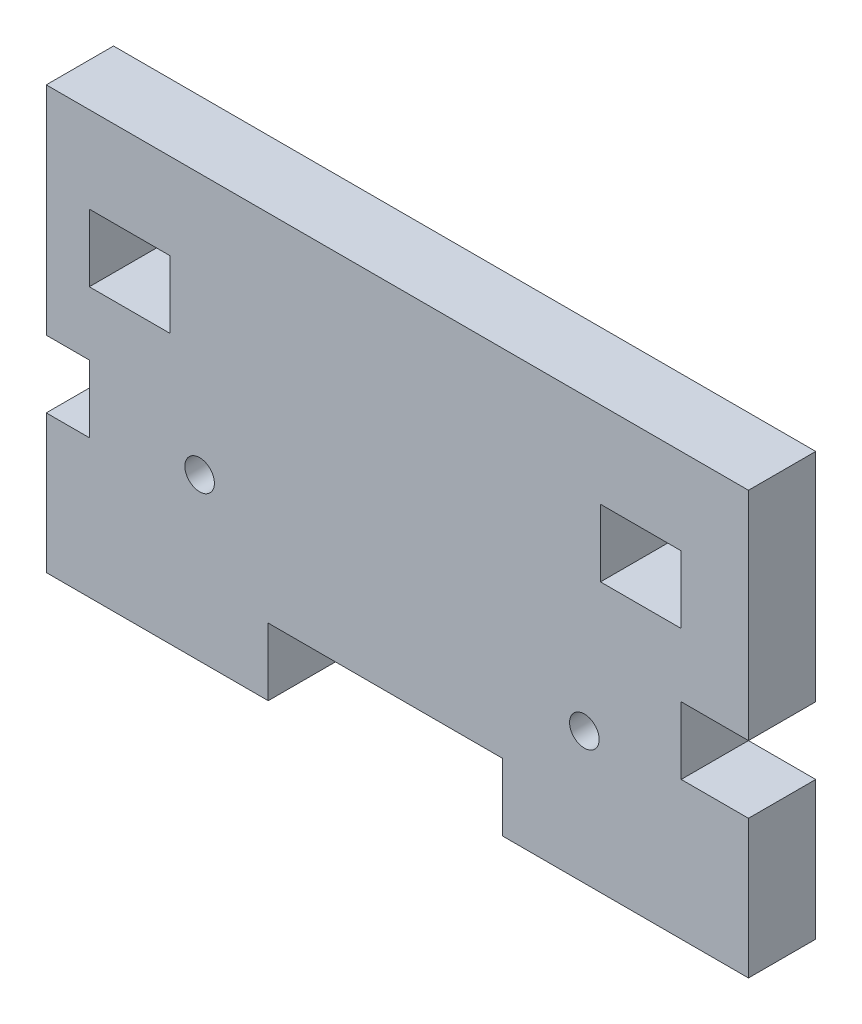
ISO-10303-21;
HEADER;
FILE_DESCRIPTION(('STEP AP214'),'2;1');
FILE_NAME('part.step','',(''),(''),'','','');
FILE_SCHEMA(('AUTOMOTIVE_DESIGN { 1 0 10303 214 1 1 1 1 }'));
ENDSEC;
DATA;
#1=APPLICATION_CONTEXT('core data for automotive mechanical design processes');
#2=APPLICATION_PROTOCOL_DEFINITION('international standard','automotive_design',2000,#1);
#3=PRODUCT_CONTEXT('',#1,'mechanical');
#4=PRODUCT('Part','Part','',(#3));
#5=PRODUCT_RELATED_PRODUCT_CATEGORY('part','',(#4));
#6=PRODUCT_DEFINITION_FORMATION('','',#4);
#7=PRODUCT_DEFINITION_CONTEXT('part definition',#1,'design');
#8=PRODUCT_DEFINITION('design','',#6,#7);
#9=PRODUCT_DEFINITION_SHAPE('','',#8);
#10=(LENGTH_UNIT() NAMED_UNIT(*) SI_UNIT(.MILLI.,.METRE.));
#11=(NAMED_UNIT(*) PLANE_ANGLE_UNIT() SI_UNIT($,.RADIAN.));
#12=(NAMED_UNIT(*) SI_UNIT($,.STERADIAN.) SOLID_ANGLE_UNIT());
#13=UNCERTAINTY_MEASURE_WITH_UNIT(LENGTH_MEASURE(1.E-05),#10,'distance_accuracy_value','');
#14=(GEOMETRIC_REPRESENTATION_CONTEXT(3) GLOBAL_UNCERTAINTY_ASSIGNED_CONTEXT((#13)) GLOBAL_UNIT_ASSIGNED_CONTEXT((#10,
#11,#12)) REPRESENTATION_CONTEXT('',''));
#15=CARTESIAN_POINT('',(0.,0.,0.));
#16=DIRECTION('',(0.,0.,1.));
#17=DIRECTION('',(1.,0.,0.));
#18=AXIS2_PLACEMENT_3D('',#15,#16,#17);
#19=CARTESIAN_POINT('',(33.147,-19.939,3.175));
#20=DIRECTION('',(-1.,0.,0.));
#21=DIRECTION('',(0.,0.,1.));
#22=AXIS2_PLACEMENT_3D('',#19,#20,#21);
#23=PLANE('',#22);
#24=DIRECTION('',(0.,1.,0.));
#25=VECTOR('',#24,1.);
#26=CARTESIAN_POINT('',(33.147,-19.939,3.175));
#27=LINE('',#26,#25);
#28=CARTESIAN_POINT('',(33.147,-0.52991232342499,3.175));
#29=VERTEX_POINT('',#28);
#30=CARTESIAN_POINT('',(33.147,19.939,3.175));
#31=VERTEX_POINT('',#30);
#32=EDGE_CURVE('E322',#29,#31,#27,.T.);
#33=ORIENTED_EDGE('',*,*,#32,.F.);
#34=DIRECTION('',(0.,0.,1.));
#35=VECTOR('',#34,1.);
#36=CARTESIAN_POINT('',(33.147,-0.52991232342499,3.175));
#37=LINE('',#36,#35);
#38=CARTESIAN_POINT('',(33.147,-0.529912323424989,-3.175));
#39=VERTEX_POINT('',#38);
#40=EDGE_CURVE('E233',#39,#29,#37,.T.);
#41=ORIENTED_EDGE('',*,*,#40,.F.);
#42=DIRECTION('',(0.,1.,0.));
#43=VECTOR('',#42,1.);
#44=CARTESIAN_POINT('',(33.147,-19.939,-3.175));
#45=LINE('',#44,#43);
#46=CARTESIAN_POINT('',(33.147,19.939,-3.175));
#47=VERTEX_POINT('',#46);
#48=EDGE_CURVE('E314',#39,#47,#45,.T.);
#49=ORIENTED_EDGE('',*,*,#48,.T.);
#50=DIRECTION('',(0.,0.,-1.));
#51=VECTOR('',#50,1.);
#52=CARTESIAN_POINT('',(33.147,19.939,3.175));
#53=LINE('',#52,#51);
#54=EDGE_CURVE('E355',#31,#47,#53,.T.);
#55=ORIENTED_EDGE('',*,*,#54,.F.);
#56=EDGE_LOOP('',(#33,#41,#49,#55));
#57=FACE_BOUND('',#56,.T.);
#58=ADVANCED_FACE('F45',(#57),#23,.F.);
#59=CARTESIAN_POINT('',(-33.147,-19.939,3.175));
#60=DIRECTION('',(1.,0.,0.));
#61=DIRECTION('',(0.,0.,-1.));
#62=AXIS2_PLACEMENT_3D('',#59,#60,#61);
#63=PLANE('',#62);
#64=DIRECTION('',(0.,-1.,0.));
#65=VECTOR('',#64,1.);
#66=CARTESIAN_POINT('',(-33.147,-19.939,-3.175));
#67=LINE('',#66,#65);
#68=CARTESIAN_POINT('',(-33.147,19.939,-3.175));
#69=VERTEX_POINT('',#68);
#70=CARTESIAN_POINT('',(-33.147,-0.529912323424995,-3.175));
#71=VERTEX_POINT('',#70);
#72=EDGE_CURVE('E341',#69,#71,#67,.T.);
#73=ORIENTED_EDGE('',*,*,#72,.T.);
#74=DIRECTION('',(0.,0.,1.));
#75=VECTOR('',#74,1.);
#76=CARTESIAN_POINT('',(-33.147,-0.529912323424996,3.175));
#77=LINE('',#76,#75);
#78=CARTESIAN_POINT('',(-33.147,-0.529912323424996,3.175));
#79=VERTEX_POINT('',#78);
#80=EDGE_CURVE('E398',#71,#79,#77,.T.);
#81=ORIENTED_EDGE('',*,*,#80,.T.);
#82=DIRECTION('',(0.,-1.,0.));
#83=VECTOR('',#82,1.);
#84=CARTESIAN_POINT('',(-33.147,-19.939,3.175));
#85=LINE('',#84,#83);
#86=CARTESIAN_POINT('',(-33.147,19.939,3.175));
#87=VERTEX_POINT('',#86);
#88=EDGE_CURVE('E333',#87,#79,#85,.T.);
#89=ORIENTED_EDGE('',*,*,#88,.F.);
#90=DIRECTION('',(0.,0.,-1.));
#91=VECTOR('',#90,1.);
#92=CARTESIAN_POINT('',(-33.147,19.939,3.175));
#93=LINE('',#92,#91);
#94=EDGE_CURVE('E352',#87,#69,#93,.T.);
#95=ORIENTED_EDGE('',*,*,#94,.T.);
#96=EDGE_LOOP('',(#73,#81,#89,#95));
#97=FACE_BOUND('',#96,.T.);
#98=ADVANCED_FACE('F474',(#97),#63,.F.);
#99=CARTESIAN_POINT('',(-33.147,-19.939,3.175));
#100=DIRECTION('',(0.,1.,0.));
#101=DIRECTION('',(0.,0.,1.));
#102=AXIS2_PLACEMENT_3D('',#99,#100,#101);
#103=PLANE('',#102);
#104=DIRECTION('',(1.,0.,0.));
#105=VECTOR('',#104,1.);
#106=CARTESIAN_POINT('',(-33.147,-19.939,-3.175));
#107=LINE('',#106,#105);
#108=CARTESIAN_POINT('',(-33.147,-19.939,-3.175));
#109=VERTEX_POINT('',#108);
#110=CARTESIAN_POINT('',(-12.192,-19.939,-3.175));
#111=VERTEX_POINT('',#110);
#112=EDGE_CURVE('E324',#109,#111,#107,.T.);
#113=ORIENTED_EDGE('',*,*,#112,.T.);
#114=DIRECTION('',(0.,0.,-1.));
#115=VECTOR('',#114,1.);
#116=CARTESIAN_POINT('',(-12.192,-19.939,3.175));
#117=LINE('',#116,#115);
#118=CARTESIAN_POINT('',(-12.192,-19.939,3.175));
#119=VERTEX_POINT('',#118);
#120=EDGE_CURVE('E432',#119,#111,#117,.T.);
#121=ORIENTED_EDGE('',*,*,#120,.F.);
#122=DIRECTION('',(1.,0.,0.));
#123=VECTOR('',#122,1.);
#124=CARTESIAN_POINT('',(-33.147,-19.939,3.175));
#125=LINE('',#124,#123);
#126=CARTESIAN_POINT('',(-33.147,-19.939,3.175));
#127=VERTEX_POINT('',#126);
#128=EDGE_CURVE('E326',#127,#119,#125,.T.);
#129=ORIENTED_EDGE('',*,*,#128,.F.);
#130=DIRECTION('',(0.,0.,-1.));
#131=VECTOR('',#130,1.);
#132=CARTESIAN_POINT('',(-33.147,-19.939,3.175));
#133=LINE('',#132,#131);
#134=EDGE_CURVE('E349',#127,#109,#133,.T.);
#135=ORIENTED_EDGE('',*,*,#134,.T.);
#136=EDGE_LOOP('',(#113,#121,#129,#135));
#137=FACE_BOUND('',#136,.T.);
#138=ADVANCED_FACE('F465',(#137),#103,.F.);
#139=CARTESIAN_POINT('',(33.147,19.939,3.175));
#140=DIRECTION('',(0.,0.,-1.));
#141=DIRECTION('',(-1.,0.,0.));
#142=AXIS2_PLACEMENT_3D('',#139,#140,#141);
#143=PLANE('',#142);
#144=CARTESIAN_POINT('',(-18.669,-4.69900000000001,3.175));
#145=DIRECTION('',(0.,0.,-1.));
#146=DIRECTION('',(-1.,0.,0.));
#147=AXIS2_PLACEMENT_3D('',#144,#145,#146);
#148=CIRCLE('',#147,1.397);
#149=CARTESIAN_POINT('',(-20.066,-4.69900000000001,3.175));
#150=VERTEX_POINT('',#149);
#151=EDGE_CURVE('E520',#150,#150,#148,.T.);
#152=ORIENTED_EDGE('',*,*,#151,.T.);
#153=EDGE_LOOP('',(#152));
#154=FACE_BOUND('',#153,.T.);
#155=CARTESIAN_POINT('',(17.653,-7.49300000000001,3.175));
#156=DIRECTION('',(0.,0.,-1.));
#157=DIRECTION('',(-1.,0.,0.));
#158=AXIS2_PLACEMENT_3D('',#155,#156,#157);
#159=CIRCLE('',#158,1.397);
#160=CARTESIAN_POINT('',(16.256,-7.49300000000001,3.175));
#161=VERTEX_POINT('',#160);
#162=EDGE_CURVE('E507',#161,#161,#159,.T.);
#163=ORIENTED_EDGE('',*,*,#162,.T.);
#164=EDGE_LOOP('',(#163));
#165=FACE_BOUND('',#164,.T.);
#166=DIRECTION('',(0.,-1.,0.));
#167=VECTOR('',#166,1.);
#168=CARTESIAN_POINT('',(-12.192,-13.589,3.175));
#169=LINE('',#168,#167);
#170=CARTESIAN_POINT('',(-12.192,-13.589,3.175));
#171=VERTEX_POINT('',#170);
#172=EDGE_CURVE('E223',#171,#119,#169,.T.);
#173=ORIENTED_EDGE('',*,*,#172,.F.);
#174=DIRECTION('',(1.,0.,0.));
#175=VECTOR('',#174,1.);
#176=CARTESIAN_POINT('',(33.147,-13.589,3.175));
#177=LINE('',#176,#175);
#178=CARTESIAN_POINT('',(9.906,-13.589,3.175));
#179=VERTEX_POINT('',#178);
#180=EDGE_CURVE('E311',#171,#179,#177,.T.);
#181=ORIENTED_EDGE('',*,*,#180,.T.);
#182=DIRECTION('',(0.,-1.,0.));
#183=VECTOR('',#182,1.);
#184=CARTESIAN_POINT('',(9.906,-13.589,3.175));
#185=LINE('',#184,#183);
#186=CARTESIAN_POINT('',(9.906,-19.939,3.175));
#187=VERTEX_POINT('',#186);
#188=EDGE_CURVE('E416',#179,#187,#185,.T.);
#189=ORIENTED_EDGE('',*,*,#188,.T.);
#190=CARTESIAN_POINT('',(33.147,-19.939,3.175));
#191=VERTEX_POINT('',#190);
#192=EDGE_CURVE('E330',#187,#191,#125,.T.);
#193=ORIENTED_EDGE('',*,*,#192,.T.);
#194=CARTESIAN_POINT('',(33.147,-6.87991232342499,3.175));
#195=VERTEX_POINT('',#194);
#196=EDGE_CURVE('E49',#191,#195,#27,.T.);
#197=ORIENTED_EDGE('',*,*,#196,.T.);
#198=DIRECTION('',(1.,0.,0.));
#199=VECTOR('',#198,1.);
#200=CARTESIAN_POINT('',(26.797,-6.87991232342499,3.175));
#201=LINE('',#200,#199);
#202=CARTESIAN_POINT('',(26.797,-6.87991232342499,3.175));
#203=VERTEX_POINT('',#202);
#204=EDGE_CURVE('E228',#203,#195,#201,.T.);
#205=ORIENTED_EDGE('',*,*,#204,.F.);
#206=DIRECTION('',(0.,1.,0.));
#207=VECTOR('',#206,1.);
#208=CARTESIAN_POINT('',(26.797,19.939,3.175));
#209=LINE('',#208,#207);
#210=CARTESIAN_POINT('',(26.797,-0.52991232342499,3.175));
#211=VERTEX_POINT('',#210);
#212=EDGE_CURVE('E211',#203,#211,#209,.T.);
#213=ORIENTED_EDGE('',*,*,#212,.T.);
#214=DIRECTION('',(1.,0.,0.));
#215=VECTOR('',#214,1.);
#216=CARTESIAN_POINT('',(26.797,-0.52991232342499,3.175));
#217=LINE('',#216,#215);
#218=EDGE_CURVE('E257',#211,#29,#217,.T.);
#219=ORIENTED_EDGE('',*,*,#218,.T.);
#220=ORIENTED_EDGE('',*,*,#32,.T.);
#221=DIRECTION('',(-1.,0.,0.));
#222=VECTOR('',#221,1.);
#223=CARTESIAN_POINT('',(-33.147,19.939,3.175));
#224=LINE('',#223,#222);
#225=EDGE_CURVE('E318',#31,#87,#224,.T.);
#226=ORIENTED_EDGE('',*,*,#225,.T.);
#227=ORIENTED_EDGE('',*,*,#88,.T.);
#228=DIRECTION('',(1.,0.,0.));
#229=VECTOR('',#228,1.);
#230=CARTESIAN_POINT('',(-35.433,-0.529912323424996,3.175));
#231=LINE('',#230,#229);
#232=CARTESIAN_POINT('',(-29.083,-0.529912323424996,3.175));
#233=VERTEX_POINT('',#232);
#234=EDGE_CURVE('E278',#79,#233,#231,.T.);
#235=ORIENTED_EDGE('',*,*,#234,.T.);
#236=DIRECTION('',(0.,1.,0.));
#237=VECTOR('',#236,1.);
#238=CARTESIAN_POINT('',(-29.083,19.939,3.175));
#239=LINE('',#238,#237);
#240=CARTESIAN_POINT('',(-29.083,-6.879912323425,3.175));
#241=VERTEX_POINT('',#240);
#242=EDGE_CURVE('E396',#241,#233,#239,.T.);
#243=ORIENTED_EDGE('',*,*,#242,.F.);
#244=DIRECTION('',(1.,0.,0.));
#245=VECTOR('',#244,1.);
#246=CARTESIAN_POINT('',(-35.433,-6.879912323425,3.175));
#247=LINE('',#246,#245);
#248=CARTESIAN_POINT('',(-33.147,-6.879912323425,3.175));
#249=VERTEX_POINT('',#248);
#250=EDGE_CURVE('E275',#249,#241,#247,.T.);
#251=ORIENTED_EDGE('',*,*,#250,.F.);
#252=EDGE_CURVE('E599',#249,#127,#85,.T.);
#253=ORIENTED_EDGE('',*,*,#252,.T.);
#254=ORIENTED_EDGE('',*,*,#128,.T.);
#255=EDGE_LOOP('',(#173,#181,#189,#193,#197,#205,#213,#219,#220,#226,#227,#235,#243,#251,#253,#254));
#256=FACE_BOUND('',#255,.T.);
#257=DIRECTION('',(-1.,0.,0.));
#258=VECTOR('',#257,1.);
#259=CARTESIAN_POINT('',(33.147,5.461,3.175));
#260=LINE('',#259,#258);
#261=CARTESIAN_POINT('',(-21.463,5.461,3.175));
#262=VERTEX_POINT('',#261);
#263=CARTESIAN_POINT('',(-29.083,5.461,3.175));
#264=VERTEX_POINT('',#263);
#265=EDGE_CURVE('E307',#262,#264,#260,.T.);
#266=ORIENTED_EDGE('',*,*,#265,.T.);
#267=DIRECTION('',(0.,1.,0.));
#268=VECTOR('',#267,1.);
#269=CARTESIAN_POINT('',(-29.083,-13.589,3.175));
#270=LINE('',#269,#268);
#271=CARTESIAN_POINT('',(-29.083,11.811,3.175));
#272=VERTEX_POINT('',#271);
#273=EDGE_CURVE('E291',#264,#272,#270,.T.);
#274=ORIENTED_EDGE('',*,*,#273,.T.);
#275=DIRECTION('',(-1.,0.,0.));
#276=VECTOR('',#275,1.);
#277=CARTESIAN_POINT('',(33.147,11.811,3.175));
#278=LINE('',#277,#276);
#279=CARTESIAN_POINT('',(-21.463,11.811,3.175));
#280=VERTEX_POINT('',#279);
#281=EDGE_CURVE('E309',#280,#272,#278,.T.);
#282=ORIENTED_EDGE('',*,*,#281,.F.);
#283=DIRECTION('',(0.,1.,0.));
#284=VECTOR('',#283,1.);
#285=CARTESIAN_POINT('',(-21.463,19.939,3.175));
#286=LINE('',#285,#284);
#287=EDGE_CURVE('E394',#262,#280,#286,.T.);
#288=ORIENTED_EDGE('',*,*,#287,.F.);
#289=EDGE_LOOP('',(#266,#274,#282,#288));
#290=FACE_BOUND('',#289,.T.);
#291=DIRECTION('',(0.,1.,0.));
#292=VECTOR('',#291,1.);
#293=CARTESIAN_POINT('',(26.797,-13.589,3.175));
#294=LINE('',#293,#292);
#295=CARTESIAN_POINT('',(26.797,5.461,3.175));
#296=VERTEX_POINT('',#295);
#297=CARTESIAN_POINT('',(26.797,11.811,3.175));
#298=VERTEX_POINT('',#297);
#299=EDGE_CURVE('E71',#296,#298,#294,.T.);
#300=ORIENTED_EDGE('',*,*,#299,.F.);
#301=DIRECTION('',(1.,0.,0.));
#302=VECTOR('',#301,1.);
#303=CARTESIAN_POINT('',(33.147,5.461,3.175));
#304=LINE('',#303,#302);
#305=CARTESIAN_POINT('',(19.177,5.461,3.175));
#306=VERTEX_POINT('',#305);
#307=EDGE_CURVE('E270',#306,#296,#304,.T.);
#308=ORIENTED_EDGE('',*,*,#307,.F.);
#309=DIRECTION('',(0.,-1.,0.));
#310=VECTOR('',#309,1.);
#311=CARTESIAN_POINT('',(19.177,19.939,3.175));
#312=LINE('',#311,#310);
#313=CARTESIAN_POINT('',(19.177,11.811,3.175));
#314=VERTEX_POINT('',#313);
#315=EDGE_CURVE('E272',#314,#306,#312,.T.);
#316=ORIENTED_EDGE('',*,*,#315,.F.);
#317=DIRECTION('',(1.,0.,0.));
#318=VECTOR('',#317,1.);
#319=CARTESIAN_POINT('',(33.147,11.811,3.175));
#320=LINE('',#319,#318);
#321=EDGE_CURVE('E222',#314,#298,#320,.T.);
#322=ORIENTED_EDGE('',*,*,#321,.T.);
#323=EDGE_LOOP('',(#300,#308,#316,#322));
#324=FACE_BOUND('',#323,.T.);
#325=ADVANCED_FACE('F236',(#154,#165,#256,#290,#324),#143,.F.);
#326=CARTESIAN_POINT('',(33.147,19.939,-3.175));
#327=DIRECTION('',(0.,0.,-1.));
#328=DIRECTION('',(-1.,0.,0.));
#329=AXIS2_PLACEMENT_3D('',#326,#327,#328);
#330=PLANE('',#329);
#331=CARTESIAN_POINT('',(-18.669,-4.69900000000001,-3.175));
#332=DIRECTION('',(0.,0.,-1.));
#333=DIRECTION('',(-1.,0.,0.));
#334=AXIS2_PLACEMENT_3D('',#331,#332,#333);
#335=CIRCLE('',#334,1.397);
#336=CARTESIAN_POINT('',(-20.066,-4.69900000000001,-3.175));
#337=VERTEX_POINT('',#336);
#338=EDGE_CURVE('E523',#337,#337,#335,.T.);
#339=ORIENTED_EDGE('',*,*,#338,.F.);
#340=EDGE_LOOP('',(#339));
#341=FACE_BOUND('',#340,.T.);
#342=CARTESIAN_POINT('',(17.653,-7.49300000000001,-3.175));
#343=DIRECTION('',(0.,0.,-1.));
#344=DIRECTION('',(-1.,0.,0.));
#345=AXIS2_PLACEMENT_3D('',#342,#343,#344);
#346=CIRCLE('',#345,1.397);
#347=CARTESIAN_POINT('',(16.256,-7.49300000000001,-3.175));
#348=VERTEX_POINT('',#347);
#349=EDGE_CURVE('E517',#348,#348,#346,.T.);
#350=ORIENTED_EDGE('',*,*,#349,.F.);
#351=EDGE_LOOP('',(#350));
#352=FACE_BOUND('',#351,.T.);
#353=DIRECTION('',(0.,-1.,0.));
#354=VECTOR('',#353,1.);
#355=CARTESIAN_POINT('',(-12.192,-13.589,-3.175));
#356=LINE('',#355,#354);
#357=CARTESIAN_POINT('',(-12.192,-13.589,-3.175));
#358=VERTEX_POINT('',#357);
#359=EDGE_CURVE('E428',#358,#111,#356,.T.);
#360=ORIENTED_EDGE('',*,*,#359,.T.);
#361=ORIENTED_EDGE('',*,*,#112,.F.);
#362=CARTESIAN_POINT('',(-33.147,-6.879912323425,-3.175));
#363=VERTEX_POINT('',#362);
#364=EDGE_CURVE('E340',#363,#109,#67,.T.);
#365=ORIENTED_EDGE('',*,*,#364,.F.);
#366=DIRECTION('',(-1.,0.,0.));
#367=VECTOR('',#366,1.);
#368=CARTESIAN_POINT('',(33.147,-6.87991232342499,-3.175));
#369=LINE('',#368,#367);
#370=CARTESIAN_POINT('',(-29.083,-6.87991232342499,-3.175));
#371=VERTEX_POINT('',#370);
#372=EDGE_CURVE('E369',#371,#363,#369,.T.);
#373=ORIENTED_EDGE('',*,*,#372,.F.);
#374=DIRECTION('',(0.,1.,0.));
#375=VECTOR('',#374,1.);
#376=CARTESIAN_POINT('',(-29.083,-0.529912323424996,-3.175));
#377=LINE('',#376,#375);
#378=CARTESIAN_POINT('',(-29.083,-0.529912323424996,-3.175));
#379=VERTEX_POINT('',#378);
#380=EDGE_CURVE('E438',#371,#379,#377,.T.);
#381=ORIENTED_EDGE('',*,*,#380,.T.);
#382=DIRECTION('',(1.,0.,0.));
#383=VECTOR('',#382,1.);
#384=CARTESIAN_POINT('',(33.147,-0.529912323424989,-3.175));
#385=LINE('',#384,#383);
#386=EDGE_CURVE('E371',#71,#379,#385,.T.);
#387=ORIENTED_EDGE('',*,*,#386,.F.);
#388=ORIENTED_EDGE('',*,*,#72,.F.);
#389=DIRECTION('',(-1.,0.,0.));
#390=VECTOR('',#389,1.);
#391=CARTESIAN_POINT('',(-33.147,19.939,-3.175));
#392=LINE('',#391,#390);
#393=EDGE_CURVE('E338',#47,#69,#392,.T.);
#394=ORIENTED_EDGE('',*,*,#393,.F.);
#395=ORIENTED_EDGE('',*,*,#48,.F.);
#396=DIRECTION('',(1.,0.,0.));
#397=VECTOR('',#396,1.);
#398=CARTESIAN_POINT('',(26.797,-0.529912323424989,-3.175));
#399=LINE('',#398,#397);
#400=CARTESIAN_POINT('',(26.797,-0.529912323424989,-3.175));
#401=VERTEX_POINT('',#400);
#402=EDGE_CURVE('E240',#401,#39,#399,.T.);
#403=ORIENTED_EDGE('',*,*,#402,.F.);
#404=DIRECTION('',(0.,1.,0.));
#405=VECTOR('',#404,1.);
#406=CARTESIAN_POINT('',(26.797,-0.529912323424989,-3.175));
#407=LINE('',#406,#405);
#408=CARTESIAN_POINT('',(26.797,-6.87991232342499,-3.175));
#409=VERTEX_POINT('',#408);
#410=EDGE_CURVE('E232',#409,#401,#407,.T.);
#411=ORIENTED_EDGE('',*,*,#410,.F.);
#412=DIRECTION('',(1.,0.,0.));
#413=VECTOR('',#412,1.);
#414=CARTESIAN_POINT('',(26.797,-6.87991232342499,-3.175));
#415=LINE('',#414,#413);
#416=CARTESIAN_POINT('',(33.147,-6.87991232342499,-3.175));
#417=VERTEX_POINT('',#416);
#418=EDGE_CURVE('E231',#409,#417,#415,.T.);
#419=ORIENTED_EDGE('',*,*,#418,.T.);
#420=CARTESIAN_POINT('',(33.147,-19.939,-3.175));
#421=VERTEX_POINT('',#420);
#422=EDGE_CURVE('E334',#421,#417,#45,.T.);
#423=ORIENTED_EDGE('',*,*,#422,.F.);
#424=CARTESIAN_POINT('',(9.90599999999999,-19.939,-3.175));
#425=VERTEX_POINT('',#424);
#426=EDGE_CURVE('E344',#425,#421,#107,.T.);
#427=ORIENTED_EDGE('',*,*,#426,.F.);
#428=DIRECTION('',(0.,-1.,0.));
#429=VECTOR('',#428,1.);
#430=CARTESIAN_POINT('',(9.90599999999999,-13.589,-3.175));
#431=LINE('',#430,#429);
#432=CARTESIAN_POINT('',(9.90599999999999,-13.589,-3.175));
#433=VERTEX_POINT('',#432);
#434=EDGE_CURVE('E426',#433,#425,#431,.T.);
#435=ORIENTED_EDGE('',*,*,#434,.F.);
#436=DIRECTION('',(1.,0.,0.));
#437=VECTOR('',#436,1.);
#438=CARTESIAN_POINT('',(-12.192,-13.589,-3.175));
#439=LINE('',#438,#437);
#440=EDGE_CURVE('E405',#358,#433,#439,.T.);
#441=ORIENTED_EDGE('',*,*,#440,.F.);
#442=EDGE_LOOP('',(#360,#361,#365,#373,#381,#387,#388,#394,#395,#403,#411,#419,#423,#427,#435,#441));
#443=FACE_BOUND('',#442,.T.);
#444=DIRECTION('',(0.,-1.,0.));
#445=VECTOR('',#444,1.);
#446=CARTESIAN_POINT('',(19.177,19.939,-3.175));
#447=LINE('',#446,#445);
#448=CARTESIAN_POINT('',(19.177,11.811,-3.175));
#449=VERTEX_POINT('',#448);
#450=CARTESIAN_POINT('',(19.177,5.461,-3.175));
#451=VERTEX_POINT('',#450);
#452=EDGE_CURVE('E360',#449,#451,#447,.T.);
#453=ORIENTED_EDGE('',*,*,#452,.T.);
#454=DIRECTION('',(1.,0.,0.));
#455=VECTOR('',#454,1.);
#456=CARTESIAN_POINT('',(33.147,5.461,-3.175));
#457=LINE('',#456,#455);
#458=CARTESIAN_POINT('',(26.797,5.461,-3.175));
#459=VERTEX_POINT('',#458);
#460=EDGE_CURVE('E366',#451,#459,#457,.T.);
#461=ORIENTED_EDGE('',*,*,#460,.T.);
#462=DIRECTION('',(0.,1.,0.));
#463=VECTOR('',#462,1.);
#464=CARTESIAN_POINT('',(26.797,19.939,-3.175));
#465=LINE('',#464,#463);
#466=CARTESIAN_POINT('',(26.797,11.811,-3.175));
#467=VERTEX_POINT('',#466);
#468=EDGE_CURVE('E363',#459,#467,#465,.T.);
#469=ORIENTED_EDGE('',*,*,#468,.T.);
#470=DIRECTION('',(1.,0.,0.));
#471=VECTOR('',#470,1.);
#472=CARTESIAN_POINT('',(33.147,11.811,-3.175));
#473=LINE('',#472,#471);
#474=EDGE_CURVE('E358',#449,#467,#473,.T.);
#475=ORIENTED_EDGE('',*,*,#474,.F.);
#476=EDGE_LOOP('',(#453,#461,#469,#475));
#477=FACE_BOUND('',#476,.T.);
#478=DIRECTION('',(-1.,0.,0.));
#479=VECTOR('',#478,1.);
#480=CARTESIAN_POINT('',(33.147,11.811,-3.175));
#481=LINE('',#480,#479);
#482=CARTESIAN_POINT('',(-21.463,11.811,-3.175));
#483=VERTEX_POINT('',#482);
#484=CARTESIAN_POINT('',(-29.083,11.811,-3.175));
#485=VERTEX_POINT('',#484);
#486=EDGE_CURVE('E55',#483,#485,#481,.T.);
#487=ORIENTED_EDGE('',*,*,#486,.T.);
#488=DIRECTION('',(0.,-1.,0.));
#489=VECTOR('',#488,1.);
#490=CARTESIAN_POINT('',(-29.083,19.939,-3.175));
#491=LINE('',#490,#489);
#492=CARTESIAN_POINT('',(-29.083,5.461,-3.175));
#493=VERTEX_POINT('',#492);
#494=EDGE_CURVE('E13',#485,#493,#491,.T.);
#495=ORIENTED_EDGE('',*,*,#494,.T.);
#496=DIRECTION('',(-1.,0.,0.));
#497=VECTOR('',#496,1.);
#498=CARTESIAN_POINT('',(33.147,5.461,-3.175));
#499=LINE('',#498,#497);
#500=CARTESIAN_POINT('',(-21.463,5.461,-3.175));
#501=VERTEX_POINT('',#500);
#502=EDGE_CURVE('E376',#501,#493,#499,.T.);
#503=ORIENTED_EDGE('',*,*,#502,.F.);
#504=DIRECTION('',(0.,1.,0.));
#505=VECTOR('',#504,1.);
#506=CARTESIAN_POINT('',(-21.463,19.939,-3.175));
#507=LINE('',#506,#505);
#508=EDGE_CURVE('E373',#501,#483,#507,.T.);
#509=ORIENTED_EDGE('',*,*,#508,.T.);
#510=EDGE_LOOP('',(#487,#495,#503,#509));
#511=FACE_BOUND('',#510,.T.);
#512=ADVANCED_FACE('F380',(#341,#352,#443,#477,#511),#330,.T.);
#513=ORIENTED_EDGE('',*,*,#422,.T.);
#514=DIRECTION('',(0.,0.,-1.));
#515=VECTOR('',#514,1.);
#516=CARTESIAN_POINT('',(33.147,-6.87991232342499,3.175));
#517=LINE('',#516,#515);
#518=EDGE_CURVE('E252',#195,#417,#517,.T.);
#519=ORIENTED_EDGE('',*,*,#518,.F.);
#520=ORIENTED_EDGE('',*,*,#196,.F.);
#521=DIRECTION('',(0.,0.,-1.));
#522=VECTOR('',#521,1.);
#523=CARTESIAN_POINT('',(33.147,-19.939,3.175));
#524=LINE('',#523,#522);
#525=EDGE_CURVE('E329',#191,#421,#524,.T.);
#526=ORIENTED_EDGE('',*,*,#525,.T.);
#527=EDGE_LOOP('',(#513,#519,#520,#526));
#528=FACE_BOUND('',#527,.T.);
#529=ADVANCED_FACE('F47',(#528),#23,.F.);
#530=CARTESIAN_POINT('',(-33.147,19.939,3.175));
#531=DIRECTION('',(0.,-1.,0.));
#532=DIRECTION('',(0.,0.,-1.));
#533=AXIS2_PLACEMENT_3D('',#530,#531,#532);
#534=PLANE('',#533);
#535=ORIENTED_EDGE('',*,*,#393,.T.);
#536=ORIENTED_EDGE('',*,*,#94,.F.);
#537=ORIENTED_EDGE('',*,*,#225,.F.);
#538=ORIENTED_EDGE('',*,*,#54,.T.);
#539=EDGE_LOOP('',(#535,#536,#537,#538));
#540=FACE_BOUND('',#539,.T.);
#541=ADVANCED_FACE('F491',(#540),#534,.F.);
#542=ORIENTED_EDGE('',*,*,#252,.F.);
#543=DIRECTION('',(0.,0.,-1.));
#544=VECTOR('',#543,1.);
#545=CARTESIAN_POINT('',(-33.147,-6.879912323425,3.175));
#546=LINE('',#545,#544);
#547=EDGE_CURVE('E274',#249,#363,#546,.T.);
#548=ORIENTED_EDGE('',*,*,#547,.T.);
#549=ORIENTED_EDGE('',*,*,#364,.T.);
#550=ORIENTED_EDGE('',*,*,#134,.F.);
#551=EDGE_LOOP('',(#542,#548,#549,#550));
#552=FACE_BOUND('',#551,.T.);
#553=ADVANCED_FACE('F488',(#552),#63,.F.);
#554=ORIENTED_EDGE('',*,*,#192,.F.);
#555=DIRECTION('',(0.,0.,1.));
#556=VECTOR('',#555,1.);
#557=CARTESIAN_POINT('',(9.906,-19.939,3.175));
#558=LINE('',#557,#556);
#559=EDGE_CURVE('E421',#425,#187,#558,.T.);
#560=ORIENTED_EDGE('',*,*,#559,.F.);
#561=ORIENTED_EDGE('',*,*,#426,.T.);
#562=ORIENTED_EDGE('',*,*,#525,.F.);
#563=EDGE_LOOP('',(#554,#560,#561,#562));
#564=FACE_BOUND('',#563,.T.);
#565=ADVANCED_FACE('F477',(#564),#103,.F.);
#566=CARTESIAN_POINT('',(26.797,-0.52991232342499,3.175));
#567=DIRECTION('',(0.,1.,0.));
#568=DIRECTION('',(1.,0.,0.));
#569=AXIS2_PLACEMENT_3D('',#566,#567,#568);
#570=PLANE('',#569);
#571=ORIENTED_EDGE('',*,*,#40,.T.);
#572=ORIENTED_EDGE('',*,*,#218,.F.);
#573=DIRECTION('',(0.,0.,1.));
#574=VECTOR('',#573,1.);
#575=CARTESIAN_POINT('',(26.797,-0.52991232342499,3.175));
#576=LINE('',#575,#574);
#577=EDGE_CURVE('E217',#401,#211,#576,.T.);
#578=ORIENTED_EDGE('',*,*,#577,.F.);
#579=ORIENTED_EDGE('',*,*,#402,.T.);
#580=EDGE_LOOP('',(#571,#572,#578,#579));
#581=FACE_BOUND('',#580,.T.);
#582=ADVANCED_FACE('F542',(#581),#570,.F.);
#583=CARTESIAN_POINT('',(26.797,-6.87991232342499,3.175));
#584=DIRECTION('',(0.,-1.,0.));
#585=DIRECTION('',(-1.,0.,0.));
#586=AXIS2_PLACEMENT_3D('',#583,#584,#585);
#587=PLANE('',#586);
#588=ORIENTED_EDGE('',*,*,#518,.T.);
#589=ORIENTED_EDGE('',*,*,#418,.F.);
#590=DIRECTION('',(0.,0.,-1.));
#591=VECTOR('',#590,1.);
#592=CARTESIAN_POINT('',(26.797,-6.87991232342499,3.175));
#593=LINE('',#592,#591);
#594=EDGE_CURVE('E214',#203,#409,#593,.T.);
#595=ORIENTED_EDGE('',*,*,#594,.F.);
#596=ORIENTED_EDGE('',*,*,#204,.T.);
#597=EDGE_LOOP('',(#588,#589,#595,#596));
#598=FACE_BOUND('',#597,.T.);
#599=ADVANCED_FACE('F227',(#598),#587,.F.);
#600=CARTESIAN_POINT('',(26.797,20.955,3.175));
#601=DIRECTION('',(-1.,0.,0.));
#602=DIRECTION('',(0.,0.,1.));
#603=AXIS2_PLACEMENT_3D('',#600,#601,#602);
#604=PLANE('',#603);
#605=ORIENTED_EDGE('',*,*,#594,.T.);
#606=ORIENTED_EDGE('',*,*,#410,.T.);
#607=ORIENTED_EDGE('',*,*,#577,.T.);
#608=ORIENTED_EDGE('',*,*,#212,.F.);
#609=EDGE_LOOP('',(#605,#606,#607,#608));
#610=FACE_BOUND('',#609,.T.);
#611=ADVANCED_FACE('F213',(#610),#604,.F.);
#612=CARTESIAN_POINT('',(26.797,5.461,3.03655079519591));
#613=DIRECTION('',(0.,1.,0.));
#614=DIRECTION('',(1.,0.,0.));
#615=AXIS2_PLACEMENT_3D('',#612,#613,#614);
#616=PLANE('',#615);
#617=ORIENTED_EDGE('',*,*,#307,.T.);
#618=DIRECTION('',(0.,0.,1.));
#619=VECTOR('',#618,1.);
#620=CARTESIAN_POINT('',(26.797,5.461,33.5165507951959));
#621=LINE('',#620,#619);
#622=EDGE_CURVE('E265',#459,#296,#621,.T.);
#623=ORIENTED_EDGE('',*,*,#622,.F.);
#624=ORIENTED_EDGE('',*,*,#460,.F.);
#625=DIRECTION('',(0.,0.,-1.));
#626=VECTOR('',#625,1.);
#627=CARTESIAN_POINT('',(19.177,5.461,33.5165507951959));
#628=LINE('',#627,#626);
#629=EDGE_CURVE('E262',#306,#451,#628,.T.);
#630=ORIENTED_EDGE('',*,*,#629,.F.);
#631=EDGE_LOOP('',(#617,#623,#624,#630));
#632=FACE_BOUND('',#631,.T.);
#633=ADVANCED_FACE('F463',(#632),#616,.T.);
#634=CARTESIAN_POINT('',(26.797,11.811,3.03655079519591));
#635=DIRECTION('',(0.,1.,0.));
#636=DIRECTION('',(1.,0.,0.));
#637=AXIS2_PLACEMENT_3D('',#634,#635,#636);
#638=PLANE('',#637);
#639=DIRECTION('',(0.,0.,-1.));
#640=VECTOR('',#639,1.);
#641=CARTESIAN_POINT('',(19.177,11.811,33.5165507951959));
#642=LINE('',#641,#640);
#643=EDGE_CURVE('E268',#314,#449,#642,.T.);
#644=ORIENTED_EDGE('',*,*,#643,.T.);
#645=ORIENTED_EDGE('',*,*,#474,.T.);
#646=DIRECTION('',(0.,0.,1.));
#647=VECTOR('',#646,1.);
#648=CARTESIAN_POINT('',(26.797,11.811,33.5165507951959));
#649=LINE('',#648,#647);
#650=EDGE_CURVE('E256',#467,#298,#649,.T.);
#651=ORIENTED_EDGE('',*,*,#650,.T.);
#652=ORIENTED_EDGE('',*,*,#321,.F.);
#653=EDGE_LOOP('',(#644,#645,#651,#652));
#654=FACE_BOUND('',#653,.T.);
#655=ADVANCED_FACE('F459',(#654),#638,.F.);
#656=CARTESIAN_POINT('',(19.177,5.461,33.5165507951959));
#657=DIRECTION('',(1.,0.,0.));
#658=DIRECTION('',(0.,0.,1.));
#659=AXIS2_PLACEMENT_3D('',#656,#657,#658);
#660=PLANE('',#659);
#661=ORIENTED_EDGE('',*,*,#315,.T.);
#662=ORIENTED_EDGE('',*,*,#629,.T.);
#663=ORIENTED_EDGE('',*,*,#452,.F.);
#664=ORIENTED_EDGE('',*,*,#643,.F.);
#665=EDGE_LOOP('',(#661,#662,#663,#664));
#666=FACE_BOUND('',#665,.T.);
#667=ADVANCED_FACE('F451',(#666),#660,.T.);
#668=CARTESIAN_POINT('',(26.797,5.461,33.5165507951959));
#669=DIRECTION('',(-1.,0.,0.));
#670=DIRECTION('',(0.,0.,-1.));
#671=AXIS2_PLACEMENT_3D('',#668,#669,#670);
#672=PLANE('',#671);
#673=ORIENTED_EDGE('',*,*,#622,.T.);
#674=ORIENTED_EDGE('',*,*,#299,.T.);
#675=ORIENTED_EDGE('',*,*,#650,.F.);
#676=ORIENTED_EDGE('',*,*,#468,.F.);
#677=EDGE_LOOP('',(#673,#674,#675,#676));
#678=FACE_BOUND('',#677,.T.);
#679=ADVANCED_FACE('F461',(#678),#672,.T.);
#680=CARTESIAN_POINT('',(-35.433,-0.529912323424996,3.175));
#681=DIRECTION('',(0.,1.,0.));
#682=DIRECTION('',(1.,0.,0.));
#683=AXIS2_PLACEMENT_3D('',#680,#681,#682);
#684=PLANE('',#683);
#685=ORIENTED_EDGE('',*,*,#386,.T.);
#686=DIRECTION('',(0.,0.,1.));
#687=VECTOR('',#686,1.);
#688=CARTESIAN_POINT('',(-29.083,-0.529912323424996,3.175));
#689=LINE('',#688,#687);
#690=EDGE_CURVE('E279',#379,#233,#689,.T.);
#691=ORIENTED_EDGE('',*,*,#690,.T.);
#692=ORIENTED_EDGE('',*,*,#234,.F.);
#693=ORIENTED_EDGE('',*,*,#80,.F.);
#694=EDGE_LOOP('',(#685,#691,#692,#693));
#695=FACE_BOUND('',#694,.T.);
#696=ADVANCED_FACE('F557',(#695),#684,.F.);
#697=CARTESIAN_POINT('',(-35.433,-6.879912323425,3.175));
#698=DIRECTION('',(0.,-1.,0.));
#699=DIRECTION('',(-1.,0.,0.));
#700=AXIS2_PLACEMENT_3D('',#697,#698,#699);
#701=PLANE('',#700);
#702=ORIENTED_EDGE('',*,*,#250,.T.);
#703=DIRECTION('',(0.,0.,-1.));
#704=VECTOR('',#703,1.);
#705=CARTESIAN_POINT('',(-29.083,-6.879912323425,3.175));
#706=LINE('',#705,#704);
#707=EDGE_CURVE('E288',#241,#371,#706,.T.);
#708=ORIENTED_EDGE('',*,*,#707,.T.);
#709=ORIENTED_EDGE('',*,*,#372,.T.);
#710=ORIENTED_EDGE('',*,*,#547,.F.);
#711=EDGE_LOOP('',(#702,#708,#709,#710));
#712=FACE_BOUND('',#711,.T.);
#713=ADVANCED_FACE('F560',(#712),#701,.F.);
#714=CARTESIAN_POINT('',(-29.083,20.955,3.175));
#715=DIRECTION('',(-1.,0.,0.));
#716=DIRECTION('',(0.,0.,1.));
#717=AXIS2_PLACEMENT_3D('',#714,#715,#716);
#718=PLANE('',#717);
#719=ORIENTED_EDGE('',*,*,#242,.T.);
#720=ORIENTED_EDGE('',*,*,#690,.F.);
#721=ORIENTED_EDGE('',*,*,#380,.F.);
#722=ORIENTED_EDGE('',*,*,#707,.F.);
#723=EDGE_LOOP('',(#719,#720,#721,#722));
#724=FACE_BOUND('',#723,.T.);
#725=ADVANCED_FACE('F564',(#724),#718,.T.);
#726=CARTESIAN_POINT('',(-21.463,11.811,33.5165507951959));
#727=DIRECTION('',(-1.,0.,0.));
#728=DIRECTION('',(0.,0.,1.));
#729=AXIS2_PLACEMENT_3D('',#726,#727,#728);
#730=PLANE('',#729);
#731=ORIENTED_EDGE('',*,*,#287,.T.);
#732=DIRECTION('',(0.,0.,-1.));
#733=VECTOR('',#732,1.);
#734=CARTESIAN_POINT('',(-21.463,11.811,33.5165507951959));
#735=LINE('',#734,#733);
#736=EDGE_CURVE('E300',#280,#483,#735,.T.);
#737=ORIENTED_EDGE('',*,*,#736,.T.);
#738=ORIENTED_EDGE('',*,*,#508,.F.);
#739=DIRECTION('',(0.,0.,-1.));
#740=VECTOR('',#739,1.);
#741=CARTESIAN_POINT('',(-21.463,5.461,33.5165507951959));
#742=LINE('',#741,#740);
#743=EDGE_CURVE('E63',#262,#501,#742,.T.);
#744=ORIENTED_EDGE('',*,*,#743,.F.);
#745=EDGE_LOOP('',(#731,#737,#738,#744));
#746=FACE_BOUND('',#745,.T.);
#747=ADVANCED_FACE('F567',(#746),#730,.T.);
#748=CARTESIAN_POINT('',(-29.083,5.461,3.03655079519592));
#749=DIRECTION('',(0.,-1.,0.));
#750=DIRECTION('',(-1.,0.,0.));
#751=AXIS2_PLACEMENT_3D('',#748,#749,#750);
#752=PLANE('',#751);
#753=ORIENTED_EDGE('',*,*,#743,.T.);
#754=ORIENTED_EDGE('',*,*,#502,.T.);
#755=DIRECTION('',(0.,0.,1.));
#756=VECTOR('',#755,1.);
#757=CARTESIAN_POINT('',(-29.083,5.461,33.5165507951959));
#758=LINE('',#757,#756);
#759=EDGE_CURVE('E295',#493,#264,#758,.T.);
#760=ORIENTED_EDGE('',*,*,#759,.T.);
#761=ORIENTED_EDGE('',*,*,#265,.F.);
#762=EDGE_LOOP('',(#753,#754,#760,#761));
#763=FACE_BOUND('',#762,.T.);
#764=ADVANCED_FACE('F571',(#763),#752,.F.);
#765=CARTESIAN_POINT('',(-29.083,11.811,3.03655079519592));
#766=DIRECTION('',(0.,-1.,0.));
#767=DIRECTION('',(-1.,0.,0.));
#768=AXIS2_PLACEMENT_3D('',#765,#766,#767);
#769=PLANE('',#768);
#770=ORIENTED_EDGE('',*,*,#281,.T.);
#771=DIRECTION('',(0.,0.,1.));
#772=VECTOR('',#771,1.);
#773=CARTESIAN_POINT('',(-29.083,11.811,33.5165507951959));
#774=LINE('',#773,#772);
#775=EDGE_CURVE('E303',#485,#272,#774,.T.);
#776=ORIENTED_EDGE('',*,*,#775,.F.);
#777=ORIENTED_EDGE('',*,*,#486,.F.);
#778=ORIENTED_EDGE('',*,*,#736,.F.);
#779=EDGE_LOOP('',(#770,#776,#777,#778));
#780=FACE_BOUND('',#779,.T.);
#781=ADVANCED_FACE('F385',(#780),#769,.T.);
#782=CARTESIAN_POINT('',(-29.083,11.811,33.5165507951959));
#783=DIRECTION('',(1.,0.,0.));
#784=DIRECTION('',(0.,0.,-1.));
#785=AXIS2_PLACEMENT_3D('',#782,#783,#784);
#786=PLANE('',#785);
#787=ORIENTED_EDGE('',*,*,#775,.T.);
#788=ORIENTED_EDGE('',*,*,#273,.F.);
#789=ORIENTED_EDGE('',*,*,#759,.F.);
#790=ORIENTED_EDGE('',*,*,#494,.F.);
#791=EDGE_LOOP('',(#787,#788,#789,#790));
#792=FACE_BOUND('',#791,.T.);
#793=ADVANCED_FACE('F389',(#792),#786,.T.);
#794=CARTESIAN_POINT('',(32.004,-13.589,33.655));
#795=DIRECTION('',(0.,1.,0.));
#796=DIRECTION('',(0.,0.,1.));
#797=AXIS2_PLACEMENT_3D('',#794,#795,#796);
#798=PLANE('',#797);
#799=DIRECTION('',(0.,0.,-1.));
#800=VECTOR('',#799,1.);
#801=CARTESIAN_POINT('',(-12.192,-13.589,3.175));
#802=LINE('',#801,#800);
#803=EDGE_CURVE('E408',#171,#358,#802,.T.);
#804=ORIENTED_EDGE('',*,*,#803,.T.);
#805=ORIENTED_EDGE('',*,*,#440,.T.);
#806=DIRECTION('',(0.,0.,1.));
#807=VECTOR('',#806,1.);
#808=CARTESIAN_POINT('',(9.906,-13.589,3.175));
#809=LINE('',#808,#807);
#810=EDGE_CURVE('E407',#433,#179,#809,.T.);
#811=ORIENTED_EDGE('',*,*,#810,.T.);
#812=ORIENTED_EDGE('',*,*,#180,.F.);
#813=EDGE_LOOP('',(#804,#805,#811,#812));
#814=FACE_BOUND('',#813,.T.);
#815=ADVANCED_FACE('F578',(#814),#798,.F.);
#816=CARTESIAN_POINT('',(-12.192,-13.589,3.175));
#817=DIRECTION('',(-1.,0.,0.));
#818=DIRECTION('',(0.,0.,-1.));
#819=AXIS2_PLACEMENT_3D('',#816,#817,#818);
#820=PLANE('',#819);
#821=ORIENTED_EDGE('',*,*,#120,.T.);
#822=ORIENTED_EDGE('',*,*,#359,.F.);
#823=ORIENTED_EDGE('',*,*,#803,.F.);
#824=ORIENTED_EDGE('',*,*,#172,.T.);
#825=EDGE_LOOP('',(#821,#822,#823,#824));
#826=FACE_BOUND('',#825,.T.);
#827=ADVANCED_FACE('F581',(#826),#820,.F.);
#828=CARTESIAN_POINT('',(9.906,-13.589,3.175));
#829=DIRECTION('',(1.,0.,0.));
#830=DIRECTION('',(0.,0.,1.));
#831=AXIS2_PLACEMENT_3D('',#828,#829,#830);
#832=PLANE('',#831);
#833=ORIENTED_EDGE('',*,*,#559,.T.);
#834=ORIENTED_EDGE('',*,*,#188,.F.);
#835=ORIENTED_EDGE('',*,*,#810,.F.);
#836=ORIENTED_EDGE('',*,*,#434,.T.);
#837=EDGE_LOOP('',(#833,#834,#835,#836));
#838=FACE_BOUND('',#837,.T.);
#839=ADVANCED_FACE('F539',(#838),#832,.F.);
#840=CARTESIAN_POINT('',(17.653,-7.49300000000001,3.17505));
#841=DIRECTION('',(0.,0.,-1.));
#842=DIRECTION('',(-1.,0.,0.));
#843=AXIS2_PLACEMENT_3D('',#840,#841,#842);
#844=CYLINDRICAL_SURFACE('',#843,1.397);
#845=ORIENTED_EDGE('',*,*,#349,.T.);
#846=EDGE_LOOP('',(#845));
#847=FACE_BOUND('',#846,.T.);
#848=ORIENTED_EDGE('',*,*,#162,.F.);
#849=EDGE_LOOP('',(#848));
#850=FACE_BOUND('',#849,.T.);
#851=ADVANCED_FACE('F533',(#847,#850),#844,.F.);
#852=CARTESIAN_POINT('',(-18.669,-4.69900000000001,3.17505));
#853=DIRECTION('',(0.,0.,-1.));
#854=DIRECTION('',(-1.,0.,0.));
#855=AXIS2_PLACEMENT_3D('',#852,#853,#854);
#856=CYLINDRICAL_SURFACE('',#855,1.397);
#857=ORIENTED_EDGE('',*,*,#338,.T.);
#858=EDGE_LOOP('',(#857));
#859=FACE_BOUND('',#858,.T.);
#860=ORIENTED_EDGE('',*,*,#151,.F.);
#861=EDGE_LOOP('',(#860));
#862=FACE_BOUND('',#861,.T.);
#863=ADVANCED_FACE('F529',(#859,#862),#856,.F.);
#864=CLOSED_SHELL('',(#58,#98,#138,#325,#512,#529,#541,#553,#565,#582,#599,#611,#633,#655,#667,
#679,#696,#713,#725,#747,#764,#781,#793,#815,#827,#839,#851,#863));
#865=MANIFOLD_SOLID_BREP('B2',#864);
#866=ADVANCED_BREP_SHAPE_REPRESENTATION('',(#18,#865),#14);
#867=SHAPE_DEFINITION_REPRESENTATION(#9,#866);
ENDSEC;
END-ISO-10303-21;
